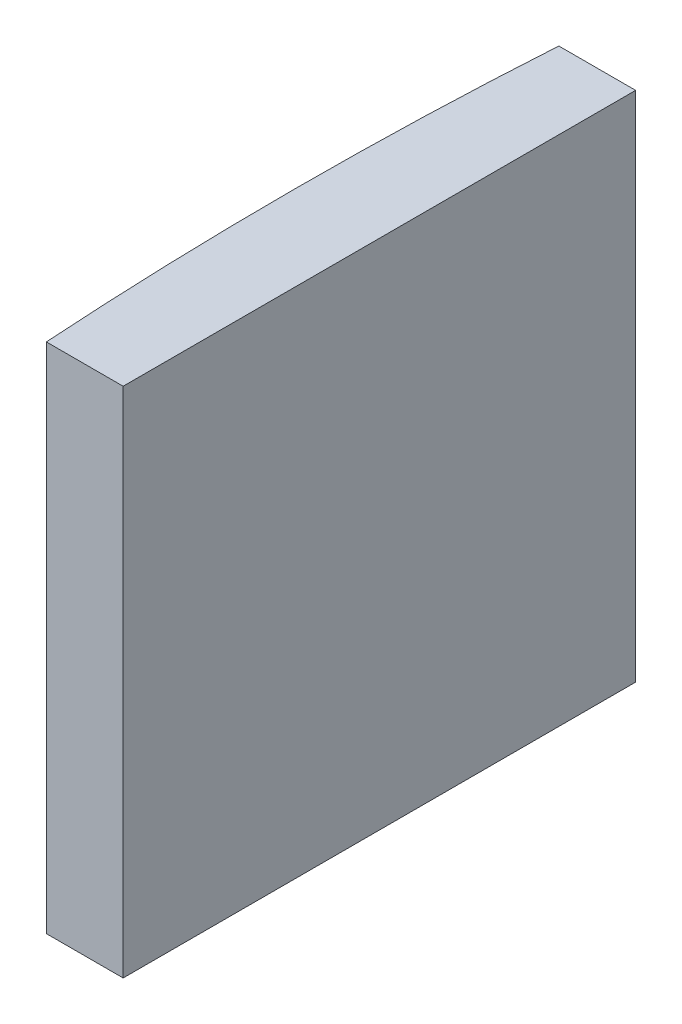
ISO-10303-21;
HEADER;
FILE_DESCRIPTION(('STEP AP214'),'2;1');
FILE_NAME('part.step','',(''),(''),'','','');
FILE_SCHEMA(('AUTOMOTIVE_DESIGN { 1 0 10303 214 1 1 1 1 }'));
ENDSEC;
DATA;
#1=APPLICATION_CONTEXT('core data for automotive mechanical design processes');
#2=APPLICATION_PROTOCOL_DEFINITION('international standard','automotive_design',2000,#1);
#3=PRODUCT_CONTEXT('',#1,'mechanical');
#4=PRODUCT('Part','Part','',(#3));
#5=PRODUCT_RELATED_PRODUCT_CATEGORY('part','',(#4));
#6=PRODUCT_DEFINITION_FORMATION('','',#4);
#7=PRODUCT_DEFINITION_CONTEXT('part definition',#1,'design');
#8=PRODUCT_DEFINITION('design','',#6,#7);
#9=PRODUCT_DEFINITION_SHAPE('','',#8);
#10=(LENGTH_UNIT() NAMED_UNIT(*) SI_UNIT(.MILLI.,.METRE.));
#11=(NAMED_UNIT(*) PLANE_ANGLE_UNIT() SI_UNIT($,.RADIAN.));
#12=(NAMED_UNIT(*) SI_UNIT($,.STERADIAN.) SOLID_ANGLE_UNIT());
#13=UNCERTAINTY_MEASURE_WITH_UNIT(LENGTH_MEASURE(1.E-05),#10,'distance_accuracy_value','');
#14=(GEOMETRIC_REPRESENTATION_CONTEXT(3) GLOBAL_UNCERTAINTY_ASSIGNED_CONTEXT((#13)) GLOBAL_UNIT_ASSIGNED_CONTEXT((#10,
#11,#12)) REPRESENTATION_CONTEXT('',''));
#15=CARTESIAN_POINT('',(0.,0.,0.));
#16=DIRECTION('',(0.,0.,1.));
#17=DIRECTION('',(1.,0.,0.));
#18=AXIS2_PLACEMENT_3D('',#15,#16,#17);
#19=CARTESIAN_POINT('',(4.35520433485127,20.,0.));
#20=DIRECTION('',(0.,-1.,0.));
#21=DIRECTION('',(0.,0.,-1.));
#22=AXIS2_PLACEMENT_3D('',#19,#20,#21);
#23=CYLINDRICAL_SURFACE('',#22,155.1);
#24=CARTESIAN_POINT('',(4.35520433485127,0.,0.));
#25=DIRECTION('',(0.,1.,0.));
#26=DIRECTION('',(0.,0.,1.));
#27=AXIS2_PLACEMENT_3D('',#24,#25,#26);
#28=CIRCLE('',#27,155.1);
#29=CARTESIAN_POINT('',(-150.422087281199,0.,-10.));
#30=VERTEX_POINT('',#29);
#31=CARTESIAN_POINT('',(-150.422087281199,0.,10.));
#32=VERTEX_POINT('',#31);
#33=EDGE_CURVE('E98',#30,#32,#28,.T.);
#34=ORIENTED_EDGE('',*,*,#33,.T.);
#35=DIRECTION('',(0.,-1.,0.));
#36=VECTOR('',#35,1.);
#37=CARTESIAN_POINT('',(-150.422087281199,20.,10.));
#38=LINE('',#37,#36);
#39=CARTESIAN_POINT('',(-150.422087281199,20.,10.));
#40=VERTEX_POINT('',#39);
#41=EDGE_CURVE('E11',#40,#32,#38,.T.);
#42=ORIENTED_EDGE('',*,*,#41,.F.);
#43=CARTESIAN_POINT('',(4.35520433485127,20.,0.));
#44=DIRECTION('',(0.,1.,0.));
#45=DIRECTION('',(0.,0.,1.));
#46=AXIS2_PLACEMENT_3D('',#43,#44,#45);
#47=CIRCLE('',#46,155.1);
#48=CARTESIAN_POINT('',(-150.422087281199,20.,-10.));
#49=VERTEX_POINT('',#48);
#50=EDGE_CURVE('E86',#49,#40,#47,.T.);
#51=ORIENTED_EDGE('',*,*,#50,.F.);
#52=DIRECTION('',(0.,-1.,0.));
#53=VECTOR('',#52,1.);
#54=CARTESIAN_POINT('',(-150.422087281199,20.,-10.));
#55=LINE('',#54,#53);
#56=EDGE_CURVE('E94',#49,#30,#55,.T.);
#57=ORIENTED_EDGE('',*,*,#56,.T.);
#58=EDGE_LOOP('',(#34,#42,#51,#57));
#59=FACE_BOUND('',#58,.T.);
#60=ADVANCED_FACE('F35',(#59),#23,.T.);
#61=CARTESIAN_POINT('',(-150.422087281199,20.,10.));
#62=DIRECTION('',(0.,0.,-1.));
#63=DIRECTION('',(-1.,0.,0.));
#64=AXIS2_PLACEMENT_3D('',#61,#62,#63);
#65=PLANE('',#64);
#66=DIRECTION('',(1.,0.,0.));
#67=VECTOR('',#66,1.);
#68=CARTESIAN_POINT('',(-150.422087281199,0.,10.));
#69=LINE('',#68,#67);
#70=CARTESIAN_POINT('',(-147.424795665149,0.,10.));
#71=VERTEX_POINT('',#70);
#72=EDGE_CURVE('E90',#32,#71,#69,.T.);
#73=ORIENTED_EDGE('',*,*,#72,.T.);
#74=DIRECTION('',(0.,-1.,0.));
#75=VECTOR('',#74,1.);
#76=CARTESIAN_POINT('',(-147.424795665149,20.,10.));
#77=LINE('',#76,#75);
#78=CARTESIAN_POINT('',(-147.424795665149,20.,10.));
#79=VERTEX_POINT('',#78);
#80=EDGE_CURVE('E43',#79,#71,#77,.T.);
#81=ORIENTED_EDGE('',*,*,#80,.F.);
#82=DIRECTION('',(1.,0.,0.));
#83=VECTOR('',#82,1.);
#84=CARTESIAN_POINT('',(-150.422087281199,20.,10.));
#85=LINE('',#84,#83);
#86=EDGE_CURVE('E81',#40,#79,#85,.T.);
#87=ORIENTED_EDGE('',*,*,#86,.F.);
#88=ORIENTED_EDGE('',*,*,#41,.T.);
#89=EDGE_LOOP('',(#73,#81,#87,#88));
#90=FACE_BOUND('',#89,.T.);
#91=ADVANCED_FACE('F89',(#90),#65,.F.);
#92=CARTESIAN_POINT('',(-147.424795665149,20.,-9.99999999999999));
#93=DIRECTION('',(-1.,0.,0.));
#94=DIRECTION('',(0.,0.,1.));
#95=AXIS2_PLACEMENT_3D('',#92,#93,#94);
#96=PLANE('',#95);
#97=DIRECTION('',(0.,0.,-1.));
#98=VECTOR('',#97,1.);
#99=CARTESIAN_POINT('',(-147.424795665149,0.,-9.99999999999999));
#100=LINE('',#99,#98);
#101=CARTESIAN_POINT('',(-147.424795665149,0.,-9.99999999999999));
#102=VERTEX_POINT('',#101);
#103=EDGE_CURVE('E68',#71,#102,#100,.T.);
#104=ORIENTED_EDGE('',*,*,#103,.T.);
#105=DIRECTION('',(0.,-1.,0.));
#106=VECTOR('',#105,1.);
#107=CARTESIAN_POINT('',(-147.424795665149,20.,-9.99999999999999));
#108=LINE('',#107,#106);
#109=CARTESIAN_POINT('',(-147.424795665149,20.,-9.99999999999999));
#110=VERTEX_POINT('',#109);
#111=EDGE_CURVE('E91',#110,#102,#108,.T.);
#112=ORIENTED_EDGE('',*,*,#111,.F.);
#113=DIRECTION('',(0.,0.,-1.));
#114=VECTOR('',#113,1.);
#115=CARTESIAN_POINT('',(-147.424795665149,20.,-9.99999999999999));
#116=LINE('',#115,#114);
#117=EDGE_CURVE('E84',#79,#110,#116,.T.);
#118=ORIENTED_EDGE('',*,*,#117,.F.);
#119=ORIENTED_EDGE('',*,*,#80,.T.);
#120=EDGE_LOOP('',(#104,#112,#118,#119));
#121=FACE_BOUND('',#120,.T.);
#122=ADVANCED_FACE('F92',(#121),#96,.F.);
#123=CARTESIAN_POINT('',(-150.422087281199,20.,-10.));
#124=DIRECTION('',(0.,0.,1.));
#125=DIRECTION('',(1.,0.,0.));
#126=AXIS2_PLACEMENT_3D('',#123,#124,#125);
#127=PLANE('',#126);
#128=DIRECTION('',(-1.,0.,0.));
#129=VECTOR('',#128,1.);
#130=CARTESIAN_POINT('',(-150.422087281199,0.,-10.));
#131=LINE('',#130,#129);
#132=EDGE_CURVE('E74',#102,#30,#131,.T.);
#133=ORIENTED_EDGE('',*,*,#132,.T.);
#134=ORIENTED_EDGE('',*,*,#56,.F.);
#135=DIRECTION('',(-1.,0.,0.));
#136=VECTOR('',#135,1.);
#137=CARTESIAN_POINT('',(-150.422087281199,20.,-10.));
#138=LINE('',#137,#136);
#139=EDGE_CURVE('E51',#110,#49,#138,.T.);
#140=ORIENTED_EDGE('',*,*,#139,.F.);
#141=ORIENTED_EDGE('',*,*,#111,.T.);
#142=EDGE_LOOP('',(#133,#134,#140,#141));
#143=FACE_BOUND('',#142,.T.);
#144=ADVANCED_FACE('F105',(#143),#127,.F.);
#145=CARTESIAN_POINT('',(4.35520433485127,20.,0.));
#146=DIRECTION('',(0.,1.,0.));
#147=DIRECTION('',(0.,0.,1.));
#148=AXIS2_PLACEMENT_3D('',#145,#146,#147);
#149=PLANE('',#148);
#150=ORIENTED_EDGE('',*,*,#50,.T.);
#151=ORIENTED_EDGE('',*,*,#86,.T.);
#152=ORIENTED_EDGE('',*,*,#117,.T.);
#153=ORIENTED_EDGE('',*,*,#139,.T.);
#154=EDGE_LOOP('',(#150,#151,#152,#153));
#155=FACE_BOUND('',#154,.T.);
#156=ADVANCED_FACE('F82',(#155),#149,.T.);
#157=CARTESIAN_POINT('',(4.35520433485127,0.,0.));
#158=DIRECTION('',(0.,1.,0.));
#159=DIRECTION('',(0.,0.,1.));
#160=AXIS2_PLACEMENT_3D('',#157,#158,#159);
#161=PLANE('',#160);
#162=ORIENTED_EDGE('',*,*,#33,.F.);
#163=ORIENTED_EDGE('',*,*,#132,.F.);
#164=ORIENTED_EDGE('',*,*,#103,.F.);
#165=ORIENTED_EDGE('',*,*,#72,.F.);
#166=EDGE_LOOP('',(#162,#163,#164,#165));
#167=FACE_BOUND('',#166,.T.);
#168=ADVANCED_FACE('F108',(#167),#161,.F.);
#169=CLOSED_SHELL('',(#60,#91,#122,#144,#156,#168));
#170=MANIFOLD_SOLID_BREP('B2',#169);
#171=ADVANCED_BREP_SHAPE_REPRESENTATION('',(#18,#170),#14);
#172=SHAPE_DEFINITION_REPRESENTATION(#9,#171);
ENDSEC;
END-ISO-10303-21;
